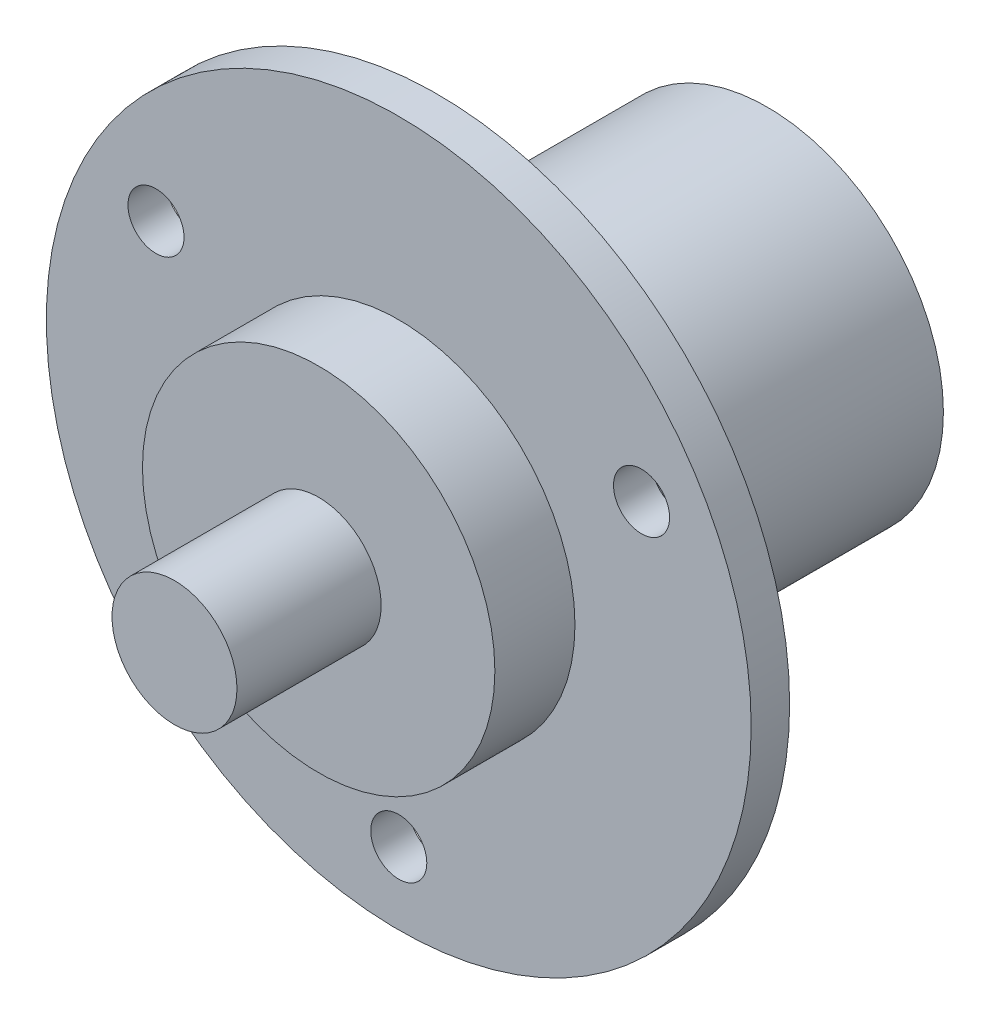
ISO-10303-21;
HEADER;
FILE_DESCRIPTION(('STEP AP214'),'2;1');
FILE_NAME('part.step','',(''),(''),'','','');
FILE_SCHEMA(('AUTOMOTIVE_DESIGN { 1 0 10303 214 1 1 1 1 }'));
ENDSEC;
DATA;
#1=APPLICATION_CONTEXT('core data for automotive mechanical design processes');
#2=APPLICATION_PROTOCOL_DEFINITION('international standard','automotive_design',2000,#1);
#3=PRODUCT_CONTEXT('',#1,'mechanical');
#4=PRODUCT('Part','Part','',(#3));
#5=PRODUCT_RELATED_PRODUCT_CATEGORY('part','',(#4));
#6=PRODUCT_DEFINITION_FORMATION('','',#4);
#7=PRODUCT_DEFINITION_CONTEXT('part definition',#1,'design');
#8=PRODUCT_DEFINITION('design','',#6,#7);
#9=PRODUCT_DEFINITION_SHAPE('','',#8);
#10=(LENGTH_UNIT() NAMED_UNIT(*) SI_UNIT(.MILLI.,.METRE.));
#11=(NAMED_UNIT(*) PLANE_ANGLE_UNIT() SI_UNIT($,.RADIAN.));
#12=(NAMED_UNIT(*) SI_UNIT($,.STERADIAN.) SOLID_ANGLE_UNIT());
#13=UNCERTAINTY_MEASURE_WITH_UNIT(LENGTH_MEASURE(1.E-05),#10,'distance_accuracy_value','');
#14=(GEOMETRIC_REPRESENTATION_CONTEXT(3) GLOBAL_UNCERTAINTY_ASSIGNED_CONTEXT((#13)) GLOBAL_UNIT_ASSIGNED_CONTEXT((#10,
#11,#12)) REPRESENTATION_CONTEXT('',''));
#15=CARTESIAN_POINT('',(0.,0.,0.));
#16=DIRECTION('',(0.,0.,1.));
#17=DIRECTION('',(1.,0.,0.));
#18=AXIS2_PLACEMENT_3D('',#15,#16,#17);
#19=CARTESIAN_POINT('',(0.,0.,2.4));
#20=DIRECTION('',(0.,0.,1.));
#21=DIRECTION('',(1.,0.,0.));
#22=AXIS2_PLACEMENT_3D('',#19,#20,#21);
#23=PLANE('',#22);
#24=CARTESIAN_POINT('',(-15.1554445662277,8.74999999999996,2.4));
#25=DIRECTION('',(0.,0.,1.));
#26=DIRECTION('',(1.,0.,0.));
#27=AXIS2_PLACEMENT_3D('',#24,#25,#26);
#28=CIRCLE('',#27,1.75);
#29=CARTESIAN_POINT('',(-13.4054445662277,8.74999999999996,2.4));
#30=VERTEX_POINT('',#29);
#31=EDGE_CURVE('E74',#30,#30,#28,.F.);
#32=ORIENTED_EDGE('',*,*,#31,.T.);
#33=EDGE_LOOP('',(#32));
#34=FACE_BOUND('',#33,.T.);
#35=CARTESIAN_POINT('',(0.,0.,2.4));
#36=DIRECTION('',(0.,0.,1.));
#37=DIRECTION('',(1.,0.,0.));
#38=AXIS2_PLACEMENT_3D('',#35,#36,#37);
#39=CIRCLE('',#38,22.);
#40=CARTESIAN_POINT('',(22.,0.,2.4));
#41=VERTEX_POINT('',#40);
#42=EDGE_CURVE('E40',#41,#41,#39,.T.);
#43=ORIENTED_EDGE('',*,*,#42,.T.);
#44=EDGE_LOOP('',(#43));
#45=FACE_BOUND('',#44,.T.);
#46=CARTESIAN_POINT('',(0.,0.,2.4));
#47=DIRECTION('',(0.,0.,1.));
#48=DIRECTION('',(1.,0.,0.));
#49=AXIS2_PLACEMENT_3D('',#46,#47,#48);
#50=CIRCLE('',#49,11.);
#51=CARTESIAN_POINT('',(11.,0.,2.4));
#52=VERTEX_POINT('',#51);
#53=EDGE_CURVE('E10',#52,#52,#50,.T.);
#54=ORIENTED_EDGE('',*,*,#53,.F.);
#55=EDGE_LOOP('',(#54));
#56=FACE_BOUND('',#55,.T.);
#57=CARTESIAN_POINT('',(15.1554445662276,8.75000000000008,2.4));
#58=DIRECTION('',(0.,0.,1.));
#59=DIRECTION('',(1.,0.,0.));
#60=AXIS2_PLACEMENT_3D('',#57,#58,#59);
#61=CIRCLE('',#60,1.75);
#62=CARTESIAN_POINT('',(16.9054445662276,8.75000000000008,2.4));
#63=VERTEX_POINT('',#62);
#64=EDGE_CURVE('E68',#63,#63,#61,.F.);
#65=ORIENTED_EDGE('',*,*,#64,.T.);
#66=EDGE_LOOP('',(#65));
#67=FACE_BOUND('',#66,.T.);
#68=CARTESIAN_POINT('',(0.,-17.5,2.4));
#69=DIRECTION('',(0.,0.,1.));
#70=DIRECTION('',(1.,0.,0.));
#71=AXIS2_PLACEMENT_3D('',#68,#69,#70);
#72=CIRCLE('',#71,1.75);
#73=CARTESIAN_POINT('',(1.75,-17.5,2.4));
#74=VERTEX_POINT('',#73);
#75=EDGE_CURVE('E80',#74,#74,#72,.F.);
#76=ORIENTED_EDGE('',*,*,#75,.T.);
#77=EDGE_LOOP('',(#76));
#78=FACE_BOUND('',#77,.T.);
#79=ADVANCED_FACE('F32',(#34,#45,#56,#67,#78),#23,.T.);
#80=CARTESIAN_POINT('',(0.,0.,0.));
#81=DIRECTION('',(0.,0.,1.));
#82=DIRECTION('',(1.,0.,0.));
#83=AXIS2_PLACEMENT_3D('',#80,#81,#82);
#84=PLANE('',#83);
#85=CARTESIAN_POINT('',(-15.1554445662277,8.74999999999996,0.));
#86=DIRECTION('',(0.,0.,1.));
#87=DIRECTION('',(1.,0.,0.));
#88=AXIS2_PLACEMENT_3D('',#85,#86,#87);
#89=CIRCLE('',#88,1.75);
#90=CARTESIAN_POINT('',(-13.4054445662277,8.74999999999996,0.));
#91=VERTEX_POINT('',#90);
#92=EDGE_CURVE('E77',#91,#91,#89,.T.);
#93=ORIENTED_EDGE('',*,*,#92,.T.);
#94=EDGE_LOOP('',(#93));
#95=FACE_BOUND('',#94,.T.);
#96=CARTESIAN_POINT('',(0.,0.,0.));
#97=DIRECTION('',(0.,0.,1.));
#98=DIRECTION('',(1.,0.,0.));
#99=AXIS2_PLACEMENT_3D('',#96,#97,#98);
#100=CIRCLE('',#99,22.);
#101=CARTESIAN_POINT('',(22.,0.,0.));
#102=VERTEX_POINT('',#101);
#103=EDGE_CURVE('E45',#102,#102,#100,.T.);
#104=ORIENTED_EDGE('',*,*,#103,.F.);
#105=EDGE_LOOP('',(#104));
#106=FACE_BOUND('',#105,.T.);
#107=CARTESIAN_POINT('',(0.,0.,0.));
#108=DIRECTION('',(0.,0.,1.));
#109=DIRECTION('',(1.,0.,0.));
#110=AXIS2_PLACEMENT_3D('',#107,#108,#109);
#111=CIRCLE('',#110,11.);
#112=CARTESIAN_POINT('',(11.,0.,0.));
#113=VERTEX_POINT('',#112);
#114=EDGE_CURVE('E52',#113,#113,#111,.T.);
#115=ORIENTED_EDGE('',*,*,#114,.T.);
#116=EDGE_LOOP('',(#115));
#117=FACE_BOUND('',#116,.T.);
#118=CARTESIAN_POINT('',(15.1554445662276,8.75000000000008,0.));
#119=DIRECTION('',(0.,0.,1.));
#120=DIRECTION('',(1.,0.,0.));
#121=AXIS2_PLACEMENT_3D('',#118,#119,#120);
#122=CIRCLE('',#121,1.75);
#123=CARTESIAN_POINT('',(16.9054445662276,8.75000000000008,0.));
#124=VERTEX_POINT('',#123);
#125=EDGE_CURVE('E71',#124,#124,#122,.T.);
#126=ORIENTED_EDGE('',*,*,#125,.T.);
#127=EDGE_LOOP('',(#126));
#128=FACE_BOUND('',#127,.T.);
#129=CARTESIAN_POINT('',(0.,-17.5,0.));
#130=DIRECTION('',(0.,0.,1.));
#131=DIRECTION('',(1.,0.,0.));
#132=AXIS2_PLACEMENT_3D('',#129,#130,#131);
#133=CIRCLE('',#132,1.75);
#134=CARTESIAN_POINT('',(1.75,-17.5,0.));
#135=VERTEX_POINT('',#134);
#136=EDGE_CURVE('E83',#135,#135,#133,.T.);
#137=ORIENTED_EDGE('',*,*,#136,.T.);
#138=EDGE_LOOP('',(#137));
#139=FACE_BOUND('',#138,.T.);
#140=ADVANCED_FACE('F87',(#95,#106,#117,#128,#139),#84,.F.);
#141=CARTESIAN_POINT('',(0.,0.,7.4));
#142=DIRECTION('',(0.,0.,1.));
#143=DIRECTION('',(1.,0.,0.));
#144=AXIS2_PLACEMENT_3D('',#141,#142,#143);
#145=PLANE('',#144);
#146=CARTESIAN_POINT('',(0.,0.,7.4));
#147=DIRECTION('',(0.,0.,1.));
#148=DIRECTION('',(1.,0.,0.));
#149=AXIS2_PLACEMENT_3D('',#146,#147,#148);
#150=CIRCLE('',#149,11.);
#151=CARTESIAN_POINT('',(11.,0.,7.4));
#152=VERTEX_POINT('',#151);
#153=EDGE_CURVE('E57',#152,#152,#150,.T.);
#154=ORIENTED_EDGE('',*,*,#153,.T.);
#155=EDGE_LOOP('',(#154));
#156=FACE_BOUND('',#155,.T.);
#157=CARTESIAN_POINT('',(0.,0.,7.4));
#158=DIRECTION('',(0.,0.,1.));
#159=DIRECTION('',(1.,0.,0.));
#160=AXIS2_PLACEMENT_3D('',#157,#158,#159);
#161=CIRCLE('',#160,3.9);
#162=CARTESIAN_POINT('',(3.9,0.,7.4));
#163=VERTEX_POINT('',#162);
#164=EDGE_CURVE('E36',#163,#163,#161,.F.);
#165=ORIENTED_EDGE('',*,*,#164,.T.);
#166=EDGE_LOOP('',(#165));
#167=FACE_BOUND('',#166,.T.);
#168=ADVANCED_FACE('F107',(#156,#167),#145,.T.);
#169=CARTESIAN_POINT('',(0.,0.,2.4));
#170=DIRECTION('',(0.,0.,-1.));
#171=DIRECTION('',(-1.,0.,0.));
#172=AXIS2_PLACEMENT_3D('',#169,#170,#171);
#173=CYLINDRICAL_SURFACE('',#172,22.);
#174=ORIENTED_EDGE('',*,*,#42,.F.);
#175=EDGE_LOOP('',(#174));
#176=FACE_BOUND('',#175,.T.);
#177=ORIENTED_EDGE('',*,*,#103,.T.);
#178=EDGE_LOOP('',(#177));
#179=FACE_BOUND('',#178,.T.);
#180=ADVANCED_FACE('F34',(#176,#179),#173,.T.);
#181=CARTESIAN_POINT('',(0.,0.,-20.6));
#182=DIRECTION('',(0.,0.,1.));
#183=DIRECTION('',(1.,0.,0.));
#184=AXIS2_PLACEMENT_3D('',#181,#182,#183);
#185=PLANE('',#184);
#186=CARTESIAN_POINT('',(0.,0.,-20.6));
#187=DIRECTION('',(0.,0.,1.));
#188=DIRECTION('',(1.,0.,0.));
#189=AXIS2_PLACEMENT_3D('',#186,#187,#188);
#190=CIRCLE('',#189,11.);
#191=CARTESIAN_POINT('',(11.,0.,-20.6));
#192=VERTEX_POINT('',#191);
#193=EDGE_CURVE('E48',#192,#192,#190,.T.);
#194=ORIENTED_EDGE('',*,*,#193,.F.);
#195=EDGE_LOOP('',(#194));
#196=FACE_BOUND('',#195,.T.);
#197=ADVANCED_FACE('F116',(#196),#185,.F.);
#198=CARTESIAN_POINT('',(0.,0.,-20.6));
#199=DIRECTION('',(0.,0.,1.));
#200=DIRECTION('',(1.,0.,0.));
#201=AXIS2_PLACEMENT_3D('',#198,#199,#200);
#202=CYLINDRICAL_SURFACE('',#201,11.);
#203=ORIENTED_EDGE('',*,*,#193,.T.);
#204=EDGE_LOOP('',(#203));
#205=FACE_BOUND('',#204,.T.);
#206=ORIENTED_EDGE('',*,*,#114,.F.);
#207=EDGE_LOOP('',(#206));
#208=FACE_BOUND('',#207,.T.);
#209=ADVANCED_FACE('F115',(#205,#208),#202,.T.);
#210=ORIENTED_EDGE('',*,*,#53,.T.);
#211=EDGE_LOOP('',(#210));
#212=FACE_BOUND('',#211,.T.);
#213=ORIENTED_EDGE('',*,*,#153,.F.);
#214=EDGE_LOOP('',(#213));
#215=FACE_BOUND('',#214,.T.);
#216=ADVANCED_FACE('F111',(#212,#215),#202,.T.);
#217=CARTESIAN_POINT('',(0.,0.,16.4));
#218=DIRECTION('',(0.,0.,-1.));
#219=DIRECTION('',(-1.,0.,0.));
#220=AXIS2_PLACEMENT_3D('',#217,#218,#219);
#221=CYLINDRICAL_SURFACE('',#220,3.9);
#222=ORIENTED_EDGE('',*,*,#164,.F.);
#223=EDGE_LOOP('',(#222));
#224=FACE_BOUND('',#223,.T.);
#225=CARTESIAN_POINT('',(0.,0.,16.4));
#226=DIRECTION('',(0.,0.,1.));
#227=DIRECTION('',(1.,0.,0.));
#228=AXIS2_PLACEMENT_3D('',#225,#226,#227);
#229=CIRCLE('',#228,3.9);
#230=CARTESIAN_POINT('',(3.9,0.,16.4));
#231=VERTEX_POINT('',#230);
#232=EDGE_CURVE('E64',#231,#231,#229,.T.);
#233=ORIENTED_EDGE('',*,*,#232,.F.);
#234=EDGE_LOOP('',(#233));
#235=FACE_BOUND('',#234,.T.);
#236=ADVANCED_FACE('F114',(#224,#235),#221,.T.);
#237=CARTESIAN_POINT('',(0.,0.,16.4));
#238=DIRECTION('',(0.,0.,1.));
#239=DIRECTION('',(1.,0.,0.));
#240=AXIS2_PLACEMENT_3D('',#237,#238,#239);
#241=PLANE('',#240);
#242=ORIENTED_EDGE('',*,*,#232,.T.);
#243=EDGE_LOOP('',(#242));
#244=FACE_BOUND('',#243,.T.);
#245=ADVANCED_FACE('F124',(#244),#241,.T.);
#246=CARTESIAN_POINT('',(15.1554445662276,8.75000000000008,16.4));
#247=DIRECTION('',(0.,0.,-1.));
#248=DIRECTION('',(-1.,0.,0.));
#249=AXIS2_PLACEMENT_3D('',#246,#247,#248);
#250=CYLINDRICAL_SURFACE('',#249,1.75);
#251=ORIENTED_EDGE('',*,*,#64,.F.);
#252=EDGE_LOOP('',(#251));
#253=FACE_BOUND('',#252,.T.);
#254=ORIENTED_EDGE('',*,*,#125,.F.);
#255=EDGE_LOOP('',(#254));
#256=FACE_BOUND('',#255,.T.);
#257=ADVANCED_FACE('F97',(#253,#256),#250,.F.);
#258=CARTESIAN_POINT('',(-15.1554445662277,8.74999999999996,16.4));
#259=DIRECTION('',(0.,0.,-1.));
#260=DIRECTION('',(-1.,0.,0.));
#261=AXIS2_PLACEMENT_3D('',#258,#259,#260);
#262=CYLINDRICAL_SURFACE('',#261,1.75);
#263=ORIENTED_EDGE('',*,*,#31,.F.);
#264=EDGE_LOOP('',(#263));
#265=FACE_BOUND('',#264,.T.);
#266=ORIENTED_EDGE('',*,*,#92,.F.);
#267=EDGE_LOOP('',(#266));
#268=FACE_BOUND('',#267,.T.);
#269=ADVANCED_FACE('F91',(#265,#268),#262,.F.);
#270=CARTESIAN_POINT('',(0.,-17.5,16.4));
#271=DIRECTION('',(0.,0.,-1.));
#272=DIRECTION('',(-1.,0.,0.));
#273=AXIS2_PLACEMENT_3D('',#270,#271,#272);
#274=CYLINDRICAL_SURFACE('',#273,1.75);
#275=ORIENTED_EDGE('',*,*,#75,.F.);
#276=EDGE_LOOP('',(#275));
#277=FACE_BOUND('',#276,.T.);
#278=ORIENTED_EDGE('',*,*,#136,.F.);
#279=EDGE_LOOP('',(#278));
#280=FACE_BOUND('',#279,.T.);
#281=ADVANCED_FACE('F89',(#277,#280),#274,.F.);
#282=CLOSED_SHELL('',(#79,#140,#168,#180,#197,#209,#216,#236,#245,#257,#269,#281));
#283=MANIFOLD_SOLID_BREP('B2',#282);
#284=ADVANCED_BREP_SHAPE_REPRESENTATION('',(#18,#283),#14);
#285=SHAPE_DEFINITION_REPRESENTATION(#9,#284);
ENDSEC;
END-ISO-10303-21;
